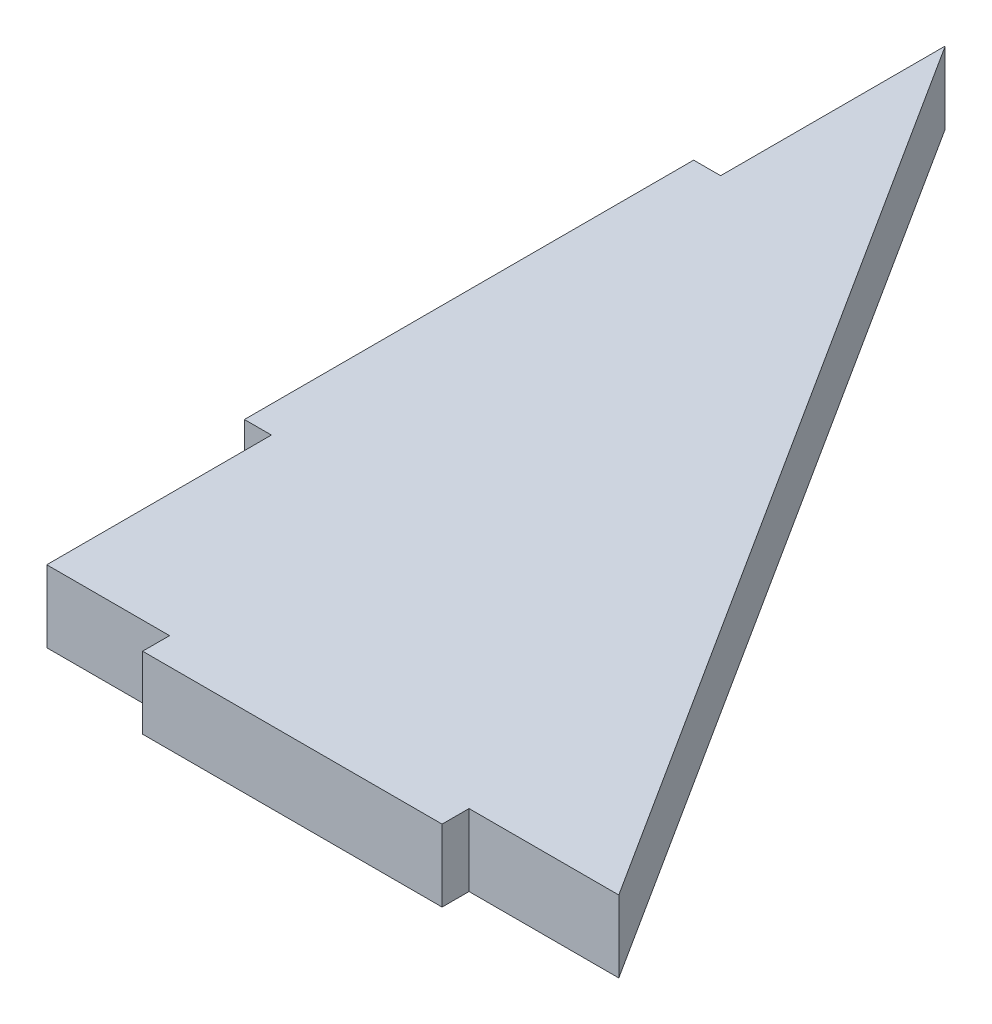
ISO-10303-21;
HEADER;
FILE_DESCRIPTION(('STEP AP214'),'2;1');
FILE_NAME('part.step','',(''),(''),'','','');
FILE_SCHEMA(('AUTOMOTIVE_DESIGN { 1 0 10303 214 1 1 1 1 }'));
ENDSEC;
DATA;
#1=APPLICATION_CONTEXT('core data for automotive mechanical design processes');
#2=APPLICATION_PROTOCOL_DEFINITION('international standard','automotive_design',2000,#1);
#3=PRODUCT_CONTEXT('',#1,'mechanical');
#4=PRODUCT('Part','Part','',(#3));
#5=PRODUCT_RELATED_PRODUCT_CATEGORY('part','',(#4));
#6=PRODUCT_DEFINITION_FORMATION('','',#4);
#7=PRODUCT_DEFINITION_CONTEXT('part definition',#1,'design');
#8=PRODUCT_DEFINITION('design','',#6,#7);
#9=PRODUCT_DEFINITION_SHAPE('','',#8);
#10=(LENGTH_UNIT() NAMED_UNIT(*) SI_UNIT(.MILLI.,.METRE.));
#11=(NAMED_UNIT(*) PLANE_ANGLE_UNIT() SI_UNIT($,.RADIAN.));
#12=(NAMED_UNIT(*) SI_UNIT($,.STERADIAN.) SOLID_ANGLE_UNIT());
#13=UNCERTAINTY_MEASURE_WITH_UNIT(LENGTH_MEASURE(1.E-05),#10,'distance_accuracy_value','');
#14=(GEOMETRIC_REPRESENTATION_CONTEXT(3) GLOBAL_UNCERTAINTY_ASSIGNED_CONTEXT((#13)) GLOBAL_UNIT_ASSIGNED_CONTEXT((#10,
#11,#12)) REPRESENTATION_CONTEXT('',''));
#15=CARTESIAN_POINT('',(0.,0.,0.));
#16=DIRECTION('',(0.,0.,1.));
#17=DIRECTION('',(1.,0.,0.));
#18=AXIS2_PLACEMENT_3D('',#15,#16,#17);
#19=CARTESIAN_POINT('',(0.,12.,0.));
#20=DIRECTION('',(0.,0.,-1.));
#21=DIRECTION('',(-1.,0.,0.));
#22=AXIS2_PLACEMENT_3D('',#19,#20,#21);
#23=PLANE('',#22);
#24=DIRECTION('',(1.,0.,0.));
#25=VECTOR('',#24,1.);
#26=CARTESIAN_POINT('',(0.,0.,0.));
#27=LINE('',#26,#25);
#28=CARTESIAN_POINT('',(0.,0.,0.));
#29=VERTEX_POINT('',#28);
#30=CARTESIAN_POINT('',(20.5,0.,0.));
#31=VERTEX_POINT('',#30);
#32=EDGE_CURVE('E169',#29,#31,#27,.T.);
#33=ORIENTED_EDGE('',*,*,#32,.T.);
#34=DIRECTION('',(0.,-1.,0.));
#35=VECTOR('',#34,1.);
#36=CARTESIAN_POINT('',(20.5,12.,0.));
#37=LINE('',#36,#35);
#38=CARTESIAN_POINT('',(20.5,12.,0.));
#39=VERTEX_POINT('',#38);
#40=EDGE_CURVE('E12',#39,#31,#37,.T.);
#41=ORIENTED_EDGE('',*,*,#40,.F.);
#42=DIRECTION('',(1.,0.,0.));
#43=VECTOR('',#42,1.);
#44=CARTESIAN_POINT('',(0.,12.,0.));
#45=LINE('',#44,#43);
#46=CARTESIAN_POINT('',(0.,12.,0.));
#47=VERTEX_POINT('',#46);
#48=EDGE_CURVE('E195',#47,#39,#45,.T.);
#49=ORIENTED_EDGE('',*,*,#48,.F.);
#50=DIRECTION('',(0.,-1.,0.));
#51=VECTOR('',#50,1.);
#52=CARTESIAN_POINT('',(0.,12.,0.));
#53=LINE('',#52,#51);
#54=EDGE_CURVE('E64',#47,#29,#53,.T.);
#55=ORIENTED_EDGE('',*,*,#54,.T.);
#56=EDGE_LOOP('',(#33,#41,#49,#55));
#57=FACE_BOUND('',#56,.T.);
#58=ADVANCED_FACE('F46',(#57),#23,.F.);
#59=CARTESIAN_POINT('',(20.5,12.,0.));
#60=DIRECTION('',(1.,0.,0.));
#61=DIRECTION('',(0.,0.,-1.));
#62=AXIS2_PLACEMENT_3D('',#59,#60,#61);
#63=PLANE('',#62);
#64=DIRECTION('',(0.,0.,1.));
#65=VECTOR('',#64,1.);
#66=CARTESIAN_POINT('',(20.5,0.,0.));
#67=LINE('',#66,#65);
#68=CARTESIAN_POINT('',(20.5,0.,4.5));
#69=VERTEX_POINT('',#68);
#70=EDGE_CURVE('E215',#31,#69,#67,.T.);
#71=ORIENTED_EDGE('',*,*,#70,.T.);
#72=DIRECTION('',(0.,-1.,0.));
#73=VECTOR('',#72,1.);
#74=CARTESIAN_POINT('',(20.5,12.,4.5));
#75=LINE('',#74,#73);
#76=CARTESIAN_POINT('',(20.5,12.,4.5));
#77=VERTEX_POINT('',#76);
#78=EDGE_CURVE('E56',#77,#69,#75,.T.);
#79=ORIENTED_EDGE('',*,*,#78,.F.);
#80=DIRECTION('',(0.,0.,1.));
#81=VECTOR('',#80,1.);
#82=CARTESIAN_POINT('',(20.5,12.,0.));
#83=LINE('',#82,#81);
#84=EDGE_CURVE('E112',#39,#77,#83,.T.);
#85=ORIENTED_EDGE('',*,*,#84,.F.);
#86=ORIENTED_EDGE('',*,*,#40,.T.);
#87=EDGE_LOOP('',(#71,#79,#85,#86));
#88=FACE_BOUND('',#87,.T.);
#89=ADVANCED_FACE('F48',(#88),#63,.F.);
#90=CARTESIAN_POINT('',(0.,12.,4.5));
#91=DIRECTION('',(0.,0.,-1.));
#92=DIRECTION('',(-1.,0.,0.));
#93=AXIS2_PLACEMENT_3D('',#90,#91,#92);
#94=PLANE('',#93);
#95=DIRECTION('',(1.,0.,0.));
#96=VECTOR('',#95,1.);
#97=CARTESIAN_POINT('',(0.,0.,4.5));
#98=LINE('',#97,#96);
#99=CARTESIAN_POINT('',(70.5,0.,4.5));
#100=VERTEX_POINT('',#99);
#101=EDGE_CURVE('E222',#69,#100,#98,.T.);
#102=ORIENTED_EDGE('',*,*,#101,.T.);
#103=DIRECTION('',(0.,-1.,0.));
#104=VECTOR('',#103,1.);
#105=CARTESIAN_POINT('',(70.5,12.,4.5));
#106=LINE('',#105,#104);
#107=CARTESIAN_POINT('',(70.5,12.,4.5));
#108=VERTEX_POINT('',#107);
#109=EDGE_CURVE('E220',#108,#100,#106,.T.);
#110=ORIENTED_EDGE('',*,*,#109,.F.);
#111=DIRECTION('',(1.,0.,0.));
#112=VECTOR('',#111,1.);
#113=CARTESIAN_POINT('',(0.,12.,4.5));
#114=LINE('',#113,#112);
#115=EDGE_CURVE('E204',#77,#108,#114,.T.);
#116=ORIENTED_EDGE('',*,*,#115,.F.);
#117=ORIENTED_EDGE('',*,*,#78,.T.);
#118=EDGE_LOOP('',(#102,#110,#116,#117));
#119=FACE_BOUND('',#118,.T.);
#120=ADVANCED_FACE('F221',(#119),#94,.F.);
#121=CARTESIAN_POINT('',(70.5,12.,-1.0870933782788E-13));
#122=DIRECTION('',(1.,0.,0.));
#123=DIRECTION('',(0.,0.,-1.));
#124=AXIS2_PLACEMENT_3D('',#121,#122,#123);
#125=PLANE('',#124);
#126=DIRECTION('',(0.,0.,1.));
#127=VECTOR('',#126,1.);
#128=CARTESIAN_POINT('',(70.5,0.,-1.0870933782788E-13));
#129=LINE('',#128,#127);
#130=CARTESIAN_POINT('',(70.5,0.,0.));
#131=VERTEX_POINT('',#130);
#132=EDGE_CURVE('E261',#131,#100,#129,.T.);
#133=ORIENTED_EDGE('',*,*,#132,.F.);
#134=DIRECTION('',(0.,-1.,0.));
#135=VECTOR('',#134,1.);
#136=CARTESIAN_POINT('',(70.5,12.,0.));
#137=LINE('',#136,#135);
#138=CARTESIAN_POINT('',(70.5,12.,0.));
#139=VERTEX_POINT('',#138);
#140=EDGE_CURVE('E227',#139,#131,#137,.T.);
#141=ORIENTED_EDGE('',*,*,#140,.F.);
#142=DIRECTION('',(0.,0.,1.));
#143=VECTOR('',#142,1.);
#144=CARTESIAN_POINT('',(70.5,12.,-1.0870933782788E-13));
#145=LINE('',#144,#143);
#146=EDGE_CURVE('E188',#139,#108,#145,.T.);
#147=ORIENTED_EDGE('',*,*,#146,.T.);
#148=ORIENTED_EDGE('',*,*,#109,.T.);
#149=EDGE_LOOP('',(#133,#141,#147,#148));
#150=FACE_BOUND('',#149,.T.);
#151=ADVANCED_FACE('F229',(#150),#125,.T.);
#152=CARTESIAN_POINT('',(95.5,0.,0.));
#153=VERTEX_POINT('',#152);
#154=EDGE_CURVE('E239',#131,#153,#27,.T.);
#155=ORIENTED_EDGE('',*,*,#154,.T.);
#156=DIRECTION('',(0.,-1.,0.));
#157=VECTOR('',#156,1.);
#158=CARTESIAN_POINT('',(95.5,12.,0.));
#159=LINE('',#158,#157);
#160=CARTESIAN_POINT('',(95.5,12.,0.));
#161=VERTEX_POINT('',#160);
#162=EDGE_CURVE('E236',#161,#153,#159,.T.);
#163=ORIENTED_EDGE('',*,*,#162,.F.);
#164=EDGE_CURVE('E187',#139,#161,#45,.T.);
#165=ORIENTED_EDGE('',*,*,#164,.F.);
#166=ORIENTED_EDGE('',*,*,#140,.T.);
#167=EDGE_LOOP('',(#155,#163,#165,#166));
#168=FACE_BOUND('',#167,.T.);
#169=ADVANCED_FACE('F237',(#168),#23,.F.);
#170=CARTESIAN_POINT('',(67.9548706920407,12.,-43.2646010072659));
#171=DIRECTION('',(0.843545687333073,0.,-0.53705742093539));
#172=DIRECTION('',(-0.53705742093539,0.,-0.843545687333073));
#173=AXIS2_PLACEMENT_3D('',#170,#171,#172);
#174=PLANE('',#173);
#175=DIRECTION('',(0.53705742093539,0.,0.843545687333073));
#176=VECTOR('',#175,1.);
#177=CARTESIAN_POINT('',(67.9548706920407,0.,-43.2646010072659));
#178=LINE('',#177,#176);
#179=CARTESIAN_POINT('',(0.,0.,-150.));
#180=VERTEX_POINT('',#179);
#181=EDGE_CURVE('E247',#180,#153,#178,.T.);
#182=ORIENTED_EDGE('',*,*,#181,.F.);
#183=DIRECTION('',(0.,-1.,0.));
#184=VECTOR('',#183,1.);
#185=CARTESIAN_POINT('',(0.,12.,-150.));
#186=LINE('',#185,#184);
#187=CARTESIAN_POINT('',(0.,12.,-150.));
#188=VERTEX_POINT('',#187);
#189=EDGE_CURVE('E244',#188,#180,#186,.T.);
#190=ORIENTED_EDGE('',*,*,#189,.F.);
#191=DIRECTION('',(0.53705742093539,0.,0.843545687333073));
#192=VECTOR('',#191,1.);
#193=CARTESIAN_POINT('',(67.9548706920407,12.,-43.2646010072659));
#194=LINE('',#193,#192);
#195=EDGE_CURVE('E181',#188,#161,#194,.T.);
#196=ORIENTED_EDGE('',*,*,#195,.T.);
#197=ORIENTED_EDGE('',*,*,#162,.T.);
#198=EDGE_LOOP('',(#182,#190,#196,#197));
#199=FACE_BOUND('',#198,.T.);
#200=ADVANCED_FACE('F246',(#199),#174,.T.);
#201=CARTESIAN_POINT('',(0.,12.,0.));
#202=DIRECTION('',(-1.,0.,0.));
#203=DIRECTION('',(0.,0.,1.));
#204=AXIS2_PLACEMENT_3D('',#201,#202,#203);
#205=PLANE('',#204);
#206=DIRECTION('',(0.,0.,-1.));
#207=VECTOR('',#206,1.);
#208=CARTESIAN_POINT('',(0.,0.,0.));
#209=LINE('',#208,#207);
#210=CARTESIAN_POINT('',(0.,0.,-112.5));
#211=VERTEX_POINT('',#210);
#212=EDGE_CURVE('E270',#211,#180,#209,.T.);
#213=ORIENTED_EDGE('',*,*,#212,.F.);
#214=DIRECTION('',(0.,-1.,0.));
#215=VECTOR('',#214,1.);
#216=CARTESIAN_POINT('',(0.,12.,-112.5));
#217=LINE('',#216,#215);
#218=CARTESIAN_POINT('',(0.,12.,-112.5));
#219=VERTEX_POINT('',#218);
#220=EDGE_CURVE('E252',#219,#211,#217,.T.);
#221=ORIENTED_EDGE('',*,*,#220,.F.);
#222=DIRECTION('',(0.,0.,-1.));
#223=VECTOR('',#222,1.);
#224=CARTESIAN_POINT('',(0.,12.,0.));
#225=LINE('',#224,#223);
#226=EDGE_CURVE('E164',#219,#188,#225,.T.);
#227=ORIENTED_EDGE('',*,*,#226,.T.);
#228=ORIENTED_EDGE('',*,*,#189,.T.);
#229=EDGE_LOOP('',(#213,#221,#227,#228));
#230=FACE_BOUND('',#229,.T.);
#231=ADVANCED_FACE('F290',(#230),#205,.T.);
#232=CARTESIAN_POINT('',(0.,12.,-112.5));
#233=DIRECTION('',(0.,0.,-1.));
#234=DIRECTION('',(-1.,0.,0.));
#235=AXIS2_PLACEMENT_3D('',#232,#233,#234);
#236=PLANE('',#235);
#237=DIRECTION('',(1.,0.,0.));
#238=VECTOR('',#237,1.);
#239=CARTESIAN_POINT('',(0.,0.,-112.5));
#240=LINE('',#239,#238);
#241=CARTESIAN_POINT('',(-4.50000000000003,0.,-112.5));
#242=VERTEX_POINT('',#241);
#243=EDGE_CURVE('E273',#242,#211,#240,.T.);
#244=ORIENTED_EDGE('',*,*,#243,.F.);
#245=DIRECTION('',(0.,-1.,0.));
#246=VECTOR('',#245,1.);
#247=CARTESIAN_POINT('',(-4.50000000000003,12.,-112.5));
#248=LINE('',#247,#246);
#249=CARTESIAN_POINT('',(-4.50000000000003,12.,-112.5));
#250=VERTEX_POINT('',#249);
#251=EDGE_CURVE('E157',#250,#242,#248,.T.);
#252=ORIENTED_EDGE('',*,*,#251,.F.);
#253=DIRECTION('',(1.,0.,0.));
#254=VECTOR('',#253,1.);
#255=CARTESIAN_POINT('',(0.,12.,-112.5));
#256=LINE('',#255,#254);
#257=EDGE_CURVE('E145',#250,#219,#256,.T.);
#258=ORIENTED_EDGE('',*,*,#257,.T.);
#259=ORIENTED_EDGE('',*,*,#220,.T.);
#260=EDGE_LOOP('',(#244,#252,#258,#259));
#261=FACE_BOUND('',#260,.T.);
#262=ADVANCED_FACE('F289',(#261),#236,.T.);
#263=CARTESIAN_POINT('',(-4.49999999999999,12.,0.));
#264=DIRECTION('',(1.,0.,0.));
#265=DIRECTION('',(0.,0.,-1.));
#266=AXIS2_PLACEMENT_3D('',#263,#264,#265);
#267=PLANE('',#266);
#268=DIRECTION('',(0.,0.,1.));
#269=VECTOR('',#268,1.);
#270=CARTESIAN_POINT('',(-4.49999999999999,0.,0.));
#271=LINE('',#270,#269);
#272=CARTESIAN_POINT('',(-4.5,0.,-37.5));
#273=VERTEX_POINT('',#272);
#274=EDGE_CURVE('E153',#242,#273,#271,.T.);
#275=ORIENTED_EDGE('',*,*,#274,.T.);
#276=DIRECTION('',(0.,-1.,0.));
#277=VECTOR('',#276,1.);
#278=CARTESIAN_POINT('',(-4.5,12.,-37.5));
#279=LINE('',#278,#277);
#280=CARTESIAN_POINT('',(-4.5,12.,-37.5));
#281=VERTEX_POINT('',#280);
#282=EDGE_CURVE('E150',#281,#273,#279,.T.);
#283=ORIENTED_EDGE('',*,*,#282,.F.);
#284=DIRECTION('',(0.,0.,1.));
#285=VECTOR('',#284,1.);
#286=CARTESIAN_POINT('',(-4.49999999999999,12.,0.));
#287=LINE('',#286,#285);
#288=EDGE_CURVE('E137',#250,#281,#287,.T.);
#289=ORIENTED_EDGE('',*,*,#288,.F.);
#290=ORIENTED_EDGE('',*,*,#251,.T.);
#291=EDGE_LOOP('',(#275,#283,#289,#290));
#292=FACE_BOUND('',#291,.T.);
#293=ADVANCED_FACE('F151',(#292),#267,.F.);
#294=CARTESIAN_POINT('',(0.,12.,-37.5));
#295=DIRECTION('',(0.,0.,-1.));
#296=DIRECTION('',(-1.,0.,0.));
#297=AXIS2_PLACEMENT_3D('',#294,#295,#296);
#298=PLANE('',#297);
#299=DIRECTION('',(1.,0.,0.));
#300=VECTOR('',#299,1.);
#301=CARTESIAN_POINT('',(0.,0.,-37.5));
#302=LINE('',#301,#300);
#303=CARTESIAN_POINT('',(0.,0.,-37.5));
#304=VERTEX_POINT('',#303);
#305=EDGE_CURVE('E279',#273,#304,#302,.T.);
#306=ORIENTED_EDGE('',*,*,#305,.T.);
#307=DIRECTION('',(0.,-1.,0.));
#308=VECTOR('',#307,1.);
#309=CARTESIAN_POINT('',(0.,12.,-37.5));
#310=LINE('',#309,#308);
#311=CARTESIAN_POINT('',(0.,12.,-37.5));
#312=VERTEX_POINT('',#311);
#313=EDGE_CURVE('E100',#312,#304,#310,.T.);
#314=ORIENTED_EDGE('',*,*,#313,.F.);
#315=DIRECTION('',(1.,0.,0.));
#316=VECTOR('',#315,1.);
#317=CARTESIAN_POINT('',(0.,12.,-37.5));
#318=LINE('',#317,#316);
#319=EDGE_CURVE('E142',#281,#312,#318,.T.);
#320=ORIENTED_EDGE('',*,*,#319,.F.);
#321=ORIENTED_EDGE('',*,*,#282,.T.);
#322=EDGE_LOOP('',(#306,#314,#320,#321));
#323=FACE_BOUND('',#322,.T.);
#324=ADVANCED_FACE('F159',(#323),#298,.F.);
#325=EDGE_CURVE('E199',#29,#304,#209,.T.);
#326=ORIENTED_EDGE('',*,*,#325,.F.);
#327=ORIENTED_EDGE('',*,*,#54,.F.);
#328=EDGE_CURVE('E161',#47,#312,#225,.T.);
#329=ORIENTED_EDGE('',*,*,#328,.T.);
#330=ORIENTED_EDGE('',*,*,#313,.T.);
#331=EDGE_LOOP('',(#326,#327,#329,#330));
#332=FACE_BOUND('',#331,.T.);
#333=ADVANCED_FACE('F293',(#332),#205,.T.);
#334=CARTESIAN_POINT('',(0.,12.,0.));
#335=DIRECTION('',(0.,1.,0.));
#336=DIRECTION('',(0.,0.,1.));
#337=AXIS2_PLACEMENT_3D('',#334,#335,#336);
#338=PLANE('',#337);
#339=ORIENTED_EDGE('',*,*,#48,.T.);
#340=ORIENTED_EDGE('',*,*,#84,.T.);
#341=ORIENTED_EDGE('',*,*,#115,.T.);
#342=ORIENTED_EDGE('',*,*,#146,.F.);
#343=ORIENTED_EDGE('',*,*,#164,.T.);
#344=ORIENTED_EDGE('',*,*,#195,.F.);
#345=ORIENTED_EDGE('',*,*,#226,.F.);
#346=ORIENTED_EDGE('',*,*,#257,.F.);
#347=ORIENTED_EDGE('',*,*,#288,.T.);
#348=ORIENTED_EDGE('',*,*,#319,.T.);
#349=ORIENTED_EDGE('',*,*,#328,.F.);
#350=EDGE_LOOP('',(#339,#340,#341,#342,#343,#344,#345,#346,#347,#348,#349));
#351=FACE_BOUND('',#350,.T.);
#352=ADVANCED_FACE('F139',(#351),#338,.T.);
#353=CARTESIAN_POINT('',(0.,0.,0.));
#354=DIRECTION('',(0.,1.,0.));
#355=DIRECTION('',(0.,0.,1.));
#356=AXIS2_PLACEMENT_3D('',#353,#354,#355);
#357=PLANE('',#356);
#358=ORIENTED_EDGE('',*,*,#32,.F.);
#359=ORIENTED_EDGE('',*,*,#325,.T.);
#360=ORIENTED_EDGE('',*,*,#305,.F.);
#361=ORIENTED_EDGE('',*,*,#274,.F.);
#362=ORIENTED_EDGE('',*,*,#243,.T.);
#363=ORIENTED_EDGE('',*,*,#212,.T.);
#364=ORIENTED_EDGE('',*,*,#181,.T.);
#365=ORIENTED_EDGE('',*,*,#154,.F.);
#366=ORIENTED_EDGE('',*,*,#132,.T.);
#367=ORIENTED_EDGE('',*,*,#101,.F.);
#368=ORIENTED_EDGE('',*,*,#70,.F.);
#369=EDGE_LOOP('',(#358,#359,#360,#361,#362,#363,#364,#365,#366,#367,#368));
#370=FACE_BOUND('',#369,.T.);
#371=ADVANCED_FACE('F260',(#370),#357,.F.);
#372=CLOSED_SHELL('',(#58,#89,#120,#151,#169,#200,#231,#262,#293,#324,#333,#352,#371));
#373=MANIFOLD_SOLID_BREP('B2',#372);
#374=ADVANCED_BREP_SHAPE_REPRESENTATION('',(#18,#373),#14);
#375=SHAPE_DEFINITION_REPRESENTATION(#9,#374);
ENDSEC;
END-ISO-10303-21;
